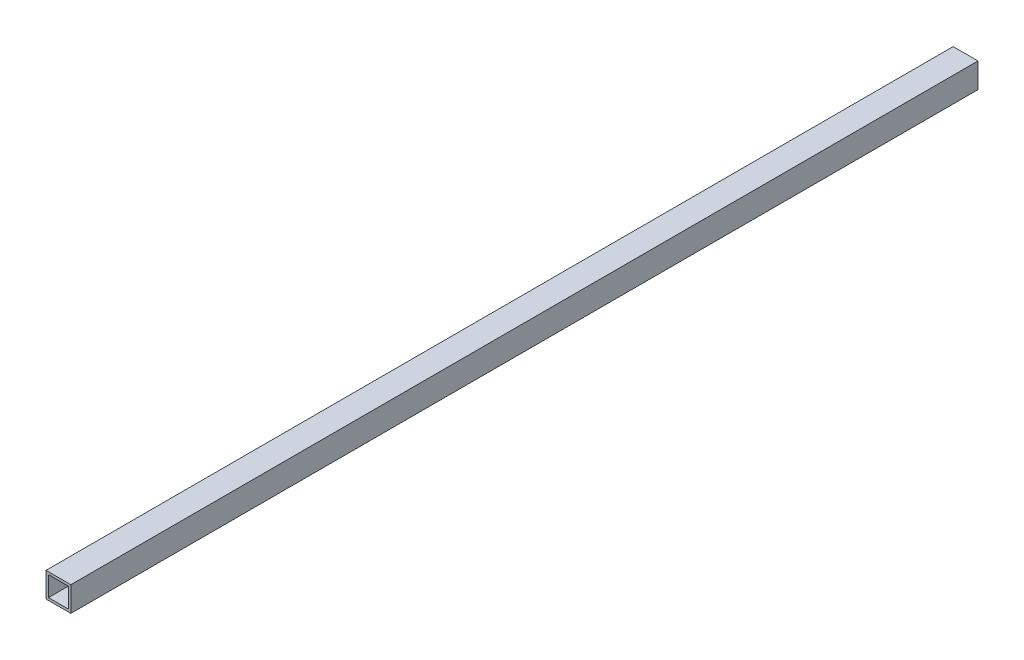
ISO-10303-21;
HEADER;
FILE_DESCRIPTION(('STEP AP214'),'2;1');
FILE_NAME('part.step','',(''),(''),'','','');
FILE_SCHEMA(('AUTOMOTIVE_DESIGN { 1 0 10303 214 1 1 1 1 }'));
ENDSEC;
DATA;
#1=APPLICATION_CONTEXT('core data for automotive mechanical design processes');
#2=APPLICATION_PROTOCOL_DEFINITION('international standard','automotive_design',2000,#1);
#3=PRODUCT_CONTEXT('',#1,'mechanical');
#4=PRODUCT('Part','Part','',(#3));
#5=PRODUCT_RELATED_PRODUCT_CATEGORY('part','',(#4));
#6=PRODUCT_DEFINITION_FORMATION('','',#4);
#7=PRODUCT_DEFINITION_CONTEXT('part definition',#1,'design');
#8=PRODUCT_DEFINITION('design','',#6,#7);
#9=PRODUCT_DEFINITION_SHAPE('','',#8);
#10=(LENGTH_UNIT() NAMED_UNIT(*) SI_UNIT(.MILLI.,.METRE.));
#11=(NAMED_UNIT(*) PLANE_ANGLE_UNIT() SI_UNIT($,.RADIAN.));
#12=(NAMED_UNIT(*) SI_UNIT($,.STERADIAN.) SOLID_ANGLE_UNIT());
#13=UNCERTAINTY_MEASURE_WITH_UNIT(LENGTH_MEASURE(1.E-05),#10,'distance_accuracy_value','');
#14=(GEOMETRIC_REPRESENTATION_CONTEXT(3) GLOBAL_UNCERTAINTY_ASSIGNED_CONTEXT((#13)) GLOBAL_UNIT_ASSIGNED_CONTEXT((#10,
#11,#12)) REPRESENTATION_CONTEXT('',''));
#15=CARTESIAN_POINT('',(0.,0.,0.));
#16=DIRECTION('',(0.,0.,1.));
#17=DIRECTION('',(1.,0.,0.));
#18=AXIS2_PLACEMENT_3D('',#15,#16,#17);
#19=CARTESIAN_POINT('',(0.,0.,730.));
#20=DIRECTION('',(0.,0.,-1.));
#21=DIRECTION('',(-1.,0.,0.));
#22=AXIS2_PLACEMENT_3D('',#19,#20,#21);
#23=PLANE('',#22);
#24=DIRECTION('',(0.,1.,0.));
#25=VECTOR('',#24,1.);
#26=CARTESIAN_POINT('',(10.,-10.,730.));
#27=LINE('',#26,#25);
#28=CARTESIAN_POINT('',(10.,-10.,730.));
#29=VERTEX_POINT('',#28);
#30=CARTESIAN_POINT('',(10.,10.,730.));
#31=VERTEX_POINT('',#30);
#32=EDGE_CURVE('E153',#29,#31,#27,.T.);
#33=ORIENTED_EDGE('',*,*,#32,.T.);
#34=DIRECTION('',(-1.,0.,0.));
#35=VECTOR('',#34,1.);
#36=CARTESIAN_POINT('',(-10.,10.,730.));
#37=LINE('',#36,#35);
#38=CARTESIAN_POINT('',(-10.,10.,730.));
#39=VERTEX_POINT('',#38);
#40=EDGE_CURVE('E157',#31,#39,#37,.T.);
#41=ORIENTED_EDGE('',*,*,#40,.T.);
#42=DIRECTION('',(0.,-1.,0.));
#43=VECTOR('',#42,1.);
#44=CARTESIAN_POINT('',(-10.,-10.,730.));
#45=LINE('',#44,#43);
#46=CARTESIAN_POINT('',(-10.,-10.,730.));
#47=VERTEX_POINT('',#46);
#48=EDGE_CURVE('E161',#39,#47,#45,.T.);
#49=ORIENTED_EDGE('',*,*,#48,.T.);
#50=DIRECTION('',(1.,0.,0.));
#51=VECTOR('',#50,1.);
#52=CARTESIAN_POINT('',(-10.,-10.,730.));
#53=LINE('',#52,#51);
#54=EDGE_CURVE('E164',#47,#29,#53,.T.);
#55=ORIENTED_EDGE('',*,*,#54,.T.);
#56=EDGE_LOOP('',(#33,#41,#49,#55));
#57=FACE_BOUND('',#56,.T.);
#58=DIRECTION('',(0.,-1.,0.));
#59=VECTOR('',#58,1.);
#60=CARTESIAN_POINT('',(-8.,-8.,730.));
#61=LINE('',#60,#59);
#62=CARTESIAN_POINT('',(-8.,8.,730.));
#63=VERTEX_POINT('',#62);
#64=CARTESIAN_POINT('',(-8.,-8.,730.));
#65=VERTEX_POINT('',#64);
#66=EDGE_CURVE('E105',#63,#65,#61,.T.);
#67=ORIENTED_EDGE('',*,*,#66,.F.);
#68=DIRECTION('',(-1.,0.,0.));
#69=VECTOR('',#68,1.);
#70=CARTESIAN_POINT('',(-8.,8.,730.));
#71=LINE('',#70,#69);
#72=CARTESIAN_POINT('',(8.,8.,730.));
#73=VERTEX_POINT('',#72);
#74=EDGE_CURVE('E131',#73,#63,#71,.T.);
#75=ORIENTED_EDGE('',*,*,#74,.F.);
#76=DIRECTION('',(0.,1.,0.));
#77=VECTOR('',#76,1.);
#78=CARTESIAN_POINT('',(8.,-8.,730.));
#79=LINE('',#78,#77);
#80=CARTESIAN_POINT('',(8.,-8.,730.));
#81=VERTEX_POINT('',#80);
#82=EDGE_CURVE('E127',#81,#73,#79,.T.);
#83=ORIENTED_EDGE('',*,*,#82,.F.);
#84=DIRECTION('',(1.,0.,0.));
#85=VECTOR('',#84,1.);
#86=CARTESIAN_POINT('',(-8.,-8.,730.));
#87=LINE('',#86,#85);
#88=EDGE_CURVE('E114',#65,#81,#87,.T.);
#89=ORIENTED_EDGE('',*,*,#88,.F.);
#90=EDGE_LOOP('',(#67,#75,#83,#89));
#91=FACE_BOUND('',#90,.T.);
#92=ADVANCED_FACE('F39',(#57,#91),#23,.F.);
#93=CARTESIAN_POINT('',(0.,0.,0.));
#94=DIRECTION('',(0.,0.,-1.));
#95=DIRECTION('',(-1.,0.,0.));
#96=AXIS2_PLACEMENT_3D('',#93,#94,#95);
#97=PLANE('',#96);
#98=DIRECTION('',(0.,1.,0.));
#99=VECTOR('',#98,1.);
#100=CARTESIAN_POINT('',(10.,-10.,0.));
#101=LINE('',#100,#99);
#102=CARTESIAN_POINT('',(10.,-10.,0.));
#103=VERTEX_POINT('',#102);
#104=CARTESIAN_POINT('',(10.,10.,0.));
#105=VERTEX_POINT('',#104);
#106=EDGE_CURVE('E123',#103,#105,#101,.T.);
#107=ORIENTED_EDGE('',*,*,#106,.F.);
#108=DIRECTION('',(1.,0.,0.));
#109=VECTOR('',#108,1.);
#110=CARTESIAN_POINT('',(-10.,-10.,0.));
#111=LINE('',#110,#109);
#112=CARTESIAN_POINT('',(-10.,-10.,0.));
#113=VERTEX_POINT('',#112);
#114=EDGE_CURVE('E158',#113,#103,#111,.T.);
#115=ORIENTED_EDGE('',*,*,#114,.F.);
#116=DIRECTION('',(0.,-1.,0.));
#117=VECTOR('',#116,1.);
#118=CARTESIAN_POINT('',(-10.,-10.,0.));
#119=LINE('',#118,#117);
#120=CARTESIAN_POINT('',(-10.,10.,0.));
#121=VERTEX_POINT('',#120);
#122=EDGE_CURVE('E174',#121,#113,#119,.T.);
#123=ORIENTED_EDGE('',*,*,#122,.F.);
#124=DIRECTION('',(-1.,0.,0.));
#125=VECTOR('',#124,1.);
#126=CARTESIAN_POINT('',(-10.,10.,0.));
#127=LINE('',#126,#125);
#128=EDGE_CURVE('E171',#105,#121,#127,.T.);
#129=ORIENTED_EDGE('',*,*,#128,.F.);
#130=EDGE_LOOP('',(#107,#115,#123,#129));
#131=FACE_BOUND('',#130,.T.);
#132=DIRECTION('',(-1.,0.,0.));
#133=VECTOR('',#132,1.);
#134=CARTESIAN_POINT('',(-8.,8.,0.));
#135=LINE('',#134,#133);
#136=CARTESIAN_POINT('',(8.,8.,0.));
#137=VERTEX_POINT('',#136);
#138=CARTESIAN_POINT('',(-8.,8.,0.));
#139=VERTEX_POINT('',#138);
#140=EDGE_CURVE('E115',#137,#139,#135,.T.);
#141=ORIENTED_EDGE('',*,*,#140,.T.);
#142=DIRECTION('',(0.,-1.,0.));
#143=VECTOR('',#142,1.);
#144=CARTESIAN_POINT('',(-8.,-8.,0.));
#145=LINE('',#144,#143);
#146=CARTESIAN_POINT('',(-8.,-8.,0.));
#147=VERTEX_POINT('',#146);
#148=EDGE_CURVE('E63',#139,#147,#145,.T.);
#149=ORIENTED_EDGE('',*,*,#148,.T.);
#150=DIRECTION('',(1.,0.,0.));
#151=VECTOR('',#150,1.);
#152=CARTESIAN_POINT('',(-8.,-8.,0.));
#153=LINE('',#152,#151);
#154=CARTESIAN_POINT('',(8.,-8.,0.));
#155=VERTEX_POINT('',#154);
#156=EDGE_CURVE('E121',#147,#155,#153,.T.);
#157=ORIENTED_EDGE('',*,*,#156,.T.);
#158=DIRECTION('',(0.,1.,0.));
#159=VECTOR('',#158,1.);
#160=CARTESIAN_POINT('',(8.,-8.,0.));
#161=LINE('',#160,#159);
#162=EDGE_CURVE('E140',#155,#137,#161,.T.);
#163=ORIENTED_EDGE('',*,*,#162,.T.);
#164=EDGE_LOOP('',(#141,#149,#157,#163));
#165=FACE_BOUND('',#164,.T.);
#166=ADVANCED_FACE('F197',(#131,#165),#97,.T.);
#167=CARTESIAN_POINT('',(10.,-10.,730.));
#168=DIRECTION('',(-1.,0.,0.));
#169=DIRECTION('',(0.,0.,1.));
#170=AXIS2_PLACEMENT_3D('',#167,#168,#169);
#171=PLANE('',#170);
#172=ORIENTED_EDGE('',*,*,#106,.T.);
#173=DIRECTION('',(0.,0.,-1.));
#174=VECTOR('',#173,1.);
#175=CARTESIAN_POINT('',(10.,10.,730.));
#176=LINE('',#175,#174);
#177=EDGE_CURVE('E11',#31,#105,#176,.T.);
#178=ORIENTED_EDGE('',*,*,#177,.F.);
#179=ORIENTED_EDGE('',*,*,#32,.F.);
#180=DIRECTION('',(0.,0.,-1.));
#181=VECTOR('',#180,1.);
#182=CARTESIAN_POINT('',(10.,-10.,730.));
#183=LINE('',#182,#181);
#184=EDGE_CURVE('E167',#29,#103,#183,.T.);
#185=ORIENTED_EDGE('',*,*,#184,.T.);
#186=EDGE_LOOP('',(#172,#178,#179,#185));
#187=FACE_BOUND('',#186,.T.);
#188=ADVANCED_FACE('F41',(#187),#171,.F.);
#189=CARTESIAN_POINT('',(-10.,10.,730.));
#190=DIRECTION('',(0.,-1.,0.));
#191=DIRECTION('',(0.,0.,-1.));
#192=AXIS2_PLACEMENT_3D('',#189,#190,#191);
#193=PLANE('',#192);
#194=ORIENTED_EDGE('',*,*,#128,.T.);
#195=DIRECTION('',(0.,0.,-1.));
#196=VECTOR('',#195,1.);
#197=CARTESIAN_POINT('',(-10.,10.,730.));
#198=LINE('',#197,#196);
#199=EDGE_CURVE('E48',#39,#121,#198,.T.);
#200=ORIENTED_EDGE('',*,*,#199,.F.);
#201=ORIENTED_EDGE('',*,*,#40,.F.);
#202=ORIENTED_EDGE('',*,*,#177,.T.);
#203=EDGE_LOOP('',(#194,#200,#201,#202));
#204=FACE_BOUND('',#203,.T.);
#205=ADVANCED_FACE('F207',(#204),#193,.F.);
#206=CARTESIAN_POINT('',(-10.,-10.,730.));
#207=DIRECTION('',(1.,0.,0.));
#208=DIRECTION('',(0.,0.,-1.));
#209=AXIS2_PLACEMENT_3D('',#206,#207,#208);
#210=PLANE('',#209);
#211=ORIENTED_EDGE('',*,*,#122,.T.);
#212=DIRECTION('',(0.,0.,-1.));
#213=VECTOR('',#212,1.);
#214=CARTESIAN_POINT('',(-10.,-10.,730.));
#215=LINE('',#214,#213);
#216=EDGE_CURVE('E182',#47,#113,#215,.T.);
#217=ORIENTED_EDGE('',*,*,#216,.F.);
#218=ORIENTED_EDGE('',*,*,#48,.F.);
#219=ORIENTED_EDGE('',*,*,#199,.T.);
#220=EDGE_LOOP('',(#211,#217,#218,#219));
#221=FACE_BOUND('',#220,.T.);
#222=ADVANCED_FACE('F191',(#221),#210,.F.);
#223=CARTESIAN_POINT('',(-10.,-10.,730.));
#224=DIRECTION('',(0.,1.,0.));
#225=DIRECTION('',(0.,0.,1.));
#226=AXIS2_PLACEMENT_3D('',#223,#224,#225);
#227=PLANE('',#226);
#228=ORIENTED_EDGE('',*,*,#114,.T.);
#229=ORIENTED_EDGE('',*,*,#184,.F.);
#230=ORIENTED_EDGE('',*,*,#54,.F.);
#231=ORIENTED_EDGE('',*,*,#216,.T.);
#232=EDGE_LOOP('',(#228,#229,#230,#231));
#233=FACE_BOUND('',#232,.T.);
#234=ADVANCED_FACE('F201',(#233),#227,.F.);
#235=CARTESIAN_POINT('',(-8.,-8.,730.));
#236=DIRECTION('',(1.,0.,0.));
#237=DIRECTION('',(0.,0.,-1.));
#238=AXIS2_PLACEMENT_3D('',#235,#236,#237);
#239=PLANE('',#238);
#240=ORIENTED_EDGE('',*,*,#148,.F.);
#241=DIRECTION('',(0.,0.,-1.));
#242=VECTOR('',#241,1.);
#243=CARTESIAN_POINT('',(-8.,8.,730.));
#244=LINE('',#243,#242);
#245=EDGE_CURVE('E109',#63,#139,#244,.T.);
#246=ORIENTED_EDGE('',*,*,#245,.F.);
#247=ORIENTED_EDGE('',*,*,#66,.T.);
#248=DIRECTION('',(0.,0.,-1.));
#249=VECTOR('',#248,1.);
#250=CARTESIAN_POINT('',(-8.,-8.,730.));
#251=LINE('',#250,#249);
#252=EDGE_CURVE('E108',#65,#147,#251,.T.);
#253=ORIENTED_EDGE('',*,*,#252,.T.);
#254=EDGE_LOOP('',(#240,#246,#247,#253));
#255=FACE_BOUND('',#254,.T.);
#256=ADVANCED_FACE('F107',(#255),#239,.T.);
#257=CARTESIAN_POINT('',(-8.,-8.,730.));
#258=DIRECTION('',(0.,1.,0.));
#259=DIRECTION('',(0.,0.,1.));
#260=AXIS2_PLACEMENT_3D('',#257,#258,#259);
#261=PLANE('',#260);
#262=ORIENTED_EDGE('',*,*,#156,.F.);
#263=ORIENTED_EDGE('',*,*,#252,.F.);
#264=ORIENTED_EDGE('',*,*,#88,.T.);
#265=DIRECTION('',(0.,0.,-1.));
#266=VECTOR('',#265,1.);
#267=CARTESIAN_POINT('',(8.,-8.,730.));
#268=LINE('',#267,#266);
#269=EDGE_CURVE('E124',#81,#155,#268,.T.);
#270=ORIENTED_EDGE('',*,*,#269,.T.);
#271=EDGE_LOOP('',(#262,#263,#264,#270));
#272=FACE_BOUND('',#271,.T.);
#273=ADVANCED_FACE('F118',(#272),#261,.T.);
#274=CARTESIAN_POINT('',(8.,-8.,730.));
#275=DIRECTION('',(-1.,0.,0.));
#276=DIRECTION('',(0.,-1.,0.));
#277=AXIS2_PLACEMENT_3D('',#274,#275,#276);
#278=PLANE('',#277);
#279=ORIENTED_EDGE('',*,*,#162,.F.);
#280=ORIENTED_EDGE('',*,*,#269,.F.);
#281=ORIENTED_EDGE('',*,*,#82,.T.);
#282=DIRECTION('',(0.,0.,-1.));
#283=VECTOR('',#282,1.);
#284=CARTESIAN_POINT('',(8.,8.,730.));
#285=LINE('',#284,#283);
#286=EDGE_CURVE('E55',#73,#137,#285,.T.);
#287=ORIENTED_EDGE('',*,*,#286,.T.);
#288=EDGE_LOOP('',(#279,#280,#281,#287));
#289=FACE_BOUND('',#288,.T.);
#290=ADVANCED_FACE('F230',(#289),#278,.T.);
#291=CARTESIAN_POINT('',(-8.,8.,730.));
#292=DIRECTION('',(0.,-1.,0.));
#293=DIRECTION('',(1.,0.,0.));
#294=AXIS2_PLACEMENT_3D('',#291,#292,#293);
#295=PLANE('',#294);
#296=ORIENTED_EDGE('',*,*,#140,.F.);
#297=ORIENTED_EDGE('',*,*,#286,.F.);
#298=ORIENTED_EDGE('',*,*,#74,.T.);
#299=ORIENTED_EDGE('',*,*,#245,.T.);
#300=EDGE_LOOP('',(#296,#297,#298,#299));
#301=FACE_BOUND('',#300,.T.);
#302=ADVANCED_FACE('F234',(#301),#295,.T.);
#303=CLOSED_SHELL('',(#92,#166,#188,#205,#222,#234,#256,#273,#290,#302));
#304=MANIFOLD_SOLID_BREP('B2',#303);
#305=ADVANCED_BREP_SHAPE_REPRESENTATION('',(#18,#304),#14);
#306=SHAPE_DEFINITION_REPRESENTATION(#9,#305);
ENDSEC;
END-ISO-10303-21;
